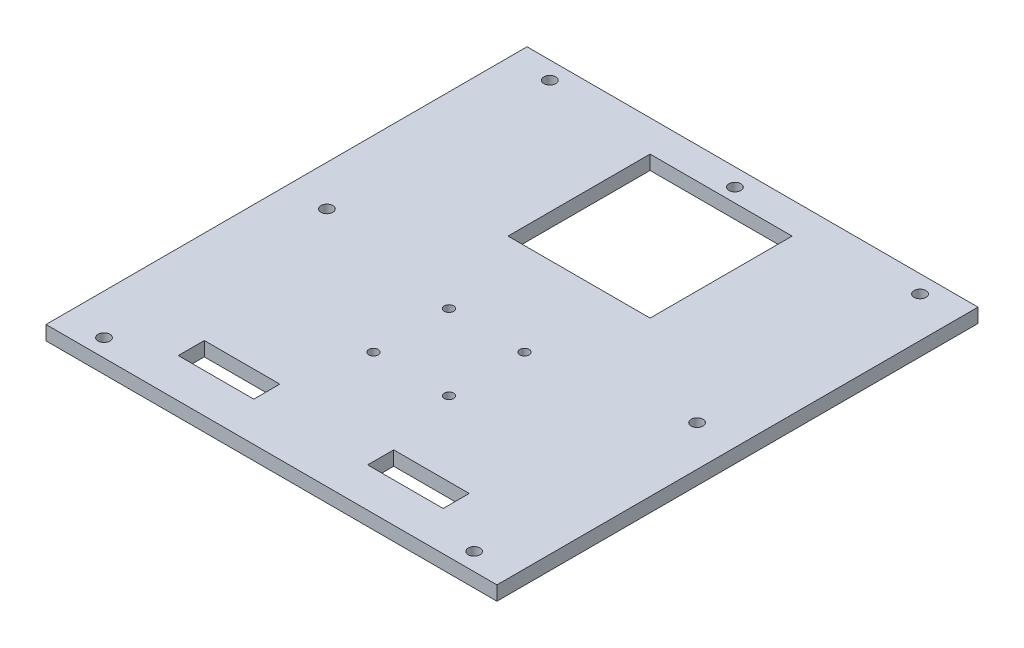
ISO-10303-21;
HEADER;
FILE_DESCRIPTION(('STEP AP214'),'2;1');
FILE_NAME('part.step','',(''),(''),'','','');
FILE_SCHEMA(('AUTOMOTIVE_DESIGN { 1 0 10303 214 1 1 1 1 }'));
ENDSEC;
DATA;
#1=APPLICATION_CONTEXT('core data for automotive mechanical design processes');
#2=APPLICATION_PROTOCOL_DEFINITION('international standard','automotive_design',2000,#1);
#3=PRODUCT_CONTEXT('',#1,'mechanical');
#4=PRODUCT('Part','Part','',(#3));
#5=PRODUCT_RELATED_PRODUCT_CATEGORY('part','',(#4));
#6=PRODUCT_DEFINITION_FORMATION('','',#4);
#7=PRODUCT_DEFINITION_CONTEXT('part definition',#1,'design');
#8=PRODUCT_DEFINITION('design','',#6,#7);
#9=PRODUCT_DEFINITION_SHAPE('','',#8);
#10=(LENGTH_UNIT() NAMED_UNIT(*) SI_UNIT(.MILLI.,.METRE.));
#11=(NAMED_UNIT(*) PLANE_ANGLE_UNIT() SI_UNIT($,.RADIAN.));
#12=(NAMED_UNIT(*) SI_UNIT($,.STERADIAN.) SOLID_ANGLE_UNIT());
#13=UNCERTAINTY_MEASURE_WITH_UNIT(LENGTH_MEASURE(1.E-05),#10,'distance_accuracy_value','');
#14=(GEOMETRIC_REPRESENTATION_CONTEXT(3) GLOBAL_UNCERTAINTY_ASSIGNED_CONTEXT((#13)) GLOBAL_UNIT_ASSIGNED_CONTEXT((#10,
#11,#12)) REPRESENTATION_CONTEXT('',''));
#15=CARTESIAN_POINT('',(0.,0.,0.));
#16=DIRECTION('',(0.,0.,1.));
#17=DIRECTION('',(1.,0.,0.));
#18=AXIS2_PLACEMENT_3D('',#15,#16,#17);
#19=CARTESIAN_POINT('',(0.,6.,0.));
#20=DIRECTION('',(0.,1.,0.));
#21=DIRECTION('',(0.,0.,1.));
#22=AXIS2_PLACEMENT_3D('',#19,#20,#21);
#23=PLANE('',#22);
#24=DIRECTION('',(0.,0.,1.));
#25=VECTOR('',#24,1.);
#26=CARTESIAN_POINT('',(-30.,6.,0.));
#27=LINE('',#26,#25);
#28=CARTESIAN_POINT('',(-30.,6.,-88.3260344038099));
#29=VERTEX_POINT('',#28);
#30=CARTESIAN_POINT('',(-30.,6.,-28.3260344038099));
#31=VERTEX_POINT('',#30);
#32=EDGE_CURVE('E50',#29,#31,#27,.T.);
#33=ORIENTED_EDGE('',*,*,#32,.F.);
#34=DIRECTION('',(1.,0.,0.));
#35=VECTOR('',#34,1.);
#36=CARTESIAN_POINT('',(0.,6.,-88.3260344038099));
#37=LINE('',#36,#35);
#38=CARTESIAN_POINT('',(30.,6.,-88.3260344038099));
#39=VERTEX_POINT('',#38);
#40=EDGE_CURVE('E171',#29,#39,#37,.T.);
#41=ORIENTED_EDGE('',*,*,#40,.T.);
#42=DIRECTION('',(0.,0.,1.));
#43=VECTOR('',#42,1.);
#44=CARTESIAN_POINT('',(30.,6.,0.));
#45=LINE('',#44,#43);
#46=CARTESIAN_POINT('',(30.,6.,-28.3260344038099));
#47=VERTEX_POINT('',#46);
#48=EDGE_CURVE('E155',#39,#47,#45,.T.);
#49=ORIENTED_EDGE('',*,*,#48,.T.);
#50=DIRECTION('',(1.,0.,0.));
#51=VECTOR('',#50,1.);
#52=CARTESIAN_POINT('',(0.,6.,-28.3260344038099));
#53=LINE('',#52,#51);
#54=EDGE_CURVE('E165',#31,#47,#53,.T.);
#55=ORIENTED_EDGE('',*,*,#54,.F.);
#56=EDGE_LOOP('',(#33,#41,#49,#55));
#57=FACE_BOUND('',#56,.T.);
#58=CARTESIAN_POINT('',(15.95,6.,42.5760390110605));
#59=DIRECTION('',(0.,1.,0.));
#60=DIRECTION('',(0.,0.,1.));
#61=AXIS2_PLACEMENT_3D('',#58,#59,#60);
#62=CIRCLE('',#61,2.);
#63=CARTESIAN_POINT('',(15.95,6.,44.5760390110605));
#64=VERTEX_POINT('',#63);
#65=EDGE_CURVE('E185',#64,#64,#62,.T.);
#66=ORIENTED_EDGE('',*,*,#65,.F.);
#67=EDGE_LOOP('',(#66));
#68=FACE_BOUND('',#67,.T.);
#69=CARTESIAN_POINT('',(-15.95,6.,42.5760390110605));
#70=DIRECTION('',(0.,1.,0.));
#71=DIRECTION('',(0.,0.,1.));
#72=AXIS2_PLACEMENT_3D('',#69,#70,#71);
#73=CIRCLE('',#72,2.);
#74=CARTESIAN_POINT('',(-15.95,6.,44.5760390110605));
#75=VERTEX_POINT('',#74);
#76=EDGE_CURVE('E181',#75,#75,#73,.T.);
#77=ORIENTED_EDGE('',*,*,#76,.F.);
#78=EDGE_LOOP('',(#77));
#79=FACE_BOUND('',#78,.T.);
#80=CARTESIAN_POINT('',(-15.95,6.,10.6760390110605));
#81=DIRECTION('',(0.,1.,0.));
#82=DIRECTION('',(0.,0.,1.));
#83=AXIS2_PLACEMENT_3D('',#80,#81,#82);
#84=CIRCLE('',#83,2.);
#85=CARTESIAN_POINT('',(-15.95,6.,12.6760390110605));
#86=VERTEX_POINT('',#85);
#87=EDGE_CURVE('E184',#86,#86,#84,.T.);
#88=ORIENTED_EDGE('',*,*,#87,.F.);
#89=EDGE_LOOP('',(#88));
#90=FACE_BOUND('',#89,.T.);
#91=CARTESIAN_POINT('',(15.95,6.,10.6760390110605));
#92=DIRECTION('',(0.,1.,0.));
#93=DIRECTION('',(0.,0.,1.));
#94=AXIS2_PLACEMENT_3D('',#91,#92,#93);
#95=CIRCLE('',#94,2.);
#96=CARTESIAN_POINT('',(15.95,6.,12.6760390110605));
#97=VERTEX_POINT('',#96);
#98=EDGE_CURVE('E218',#97,#97,#95,.T.);
#99=ORIENTED_EDGE('',*,*,#98,.F.);
#100=EDGE_LOOP('',(#99));
#101=FACE_BOUND('',#100,.T.);
#102=DIRECTION('',(0.,0.,1.));
#103=VECTOR('',#102,1.);
#104=CARTESIAN_POINT('',(-55.95,6.,0.));
#105=LINE('',#104,#103);
#106=CARTESIAN_POINT('',(-55.95,6.,74.0260390110605));
#107=VERTEX_POINT('',#106);
#108=CARTESIAN_POINT('',(-55.95,6.,85.0260390110605));
#109=VERTEX_POINT('',#108);
#110=EDGE_CURVE('E58',#107,#109,#105,.T.);
#111=ORIENTED_EDGE('',*,*,#110,.F.);
#112=DIRECTION('',(-1.,0.,0.));
#113=VECTOR('',#112,1.);
#114=CARTESIAN_POINT('',(0.,6.,74.0260390110605));
#115=LINE('',#114,#113);
#116=CARTESIAN_POINT('',(-24.05,6.,74.0260390110605));
#117=VERTEX_POINT('',#116);
#118=EDGE_CURVE('E211',#117,#107,#115,.T.);
#119=ORIENTED_EDGE('',*,*,#118,.F.);
#120=DIRECTION('',(0.,0.,1.));
#121=VECTOR('',#120,1.);
#122=CARTESIAN_POINT('',(-24.05,6.,0.));
#123=LINE('',#122,#121);
#124=CARTESIAN_POINT('',(-24.05,6.,85.0260390110605));
#125=VERTEX_POINT('',#124);
#126=EDGE_CURVE('E221',#117,#125,#123,.T.);
#127=ORIENTED_EDGE('',*,*,#126,.T.);
#128=DIRECTION('',(1.,0.,0.));
#129=VECTOR('',#128,1.);
#130=CARTESIAN_POINT('',(0.,6.,85.0260390110605));
#131=LINE('',#130,#129);
#132=EDGE_CURVE('E224',#109,#125,#131,.T.);
#133=ORIENTED_EDGE('',*,*,#132,.F.);
#134=EDGE_LOOP('',(#111,#119,#127,#133));
#135=FACE_BOUND('',#134,.T.);
#136=CARTESIAN_POINT('',(78.1870361579999,6.,94.1650737980001));
#137=DIRECTION('',(0.,1.,0.));
#138=DIRECTION('',(0.,0.,1.));
#139=AXIS2_PLACEMENT_3D('',#136,#137,#138);
#140=CIRCLE('',#139,2.5);
#141=CARTESIAN_POINT('',(78.1870361579999,6.,96.6650737980001));
#142=VERTEX_POINT('',#141);
#143=EDGE_CURVE('E263',#142,#142,#140,.T.);
#144=ORIENTED_EDGE('',*,*,#143,.F.);
#145=EDGE_LOOP('',(#144));
#146=FACE_BOUND('',#145,.T.);
#147=CARTESIAN_POINT('',(78.187036158,6.,-94.165073798));
#148=DIRECTION('',(0.,-1.,0.));
#149=DIRECTION('',(0.,0.,-1.));
#150=AXIS2_PLACEMENT_3D('',#147,#148,#149);
#151=CIRCLE('',#150,2.5);
#152=CARTESIAN_POINT('',(78.187036158,6.,-96.6650737980001));
#153=VERTEX_POINT('',#152);
#154=EDGE_CURVE('E239',#153,#153,#151,.T.);
#155=ORIENTED_EDGE('',*,*,#154,.T.);
#156=EDGE_LOOP('',(#155));
#157=FACE_BOUND('',#156,.T.);
#158=CARTESIAN_POINT('',(0.,6.,-94.165073798));
#159=DIRECTION('',(0.,1.,0.));
#160=DIRECTION('',(0.,0.,1.));
#161=AXIS2_PLACEMENT_3D('',#158,#159,#160);
#162=CIRCLE('',#161,2.5);
#163=CARTESIAN_POINT('',(0.,6.,-91.665073798));
#164=VERTEX_POINT('',#163);
#165=EDGE_CURVE('E232',#164,#164,#162,.T.);
#166=ORIENTED_EDGE('',*,*,#165,.F.);
#167=EDGE_LOOP('',(#166));
#168=FACE_BOUND('',#167,.T.);
#169=CARTESIAN_POINT('',(-78.187036158,6.,-94.165073798));
#170=DIRECTION('',(0.,1.,0.));
#171=DIRECTION('',(0.,0.,1.));
#172=AXIS2_PLACEMENT_3D('',#169,#170,#171);
#173=CIRCLE('',#172,2.5);
#174=CARTESIAN_POINT('',(-78.187036158,6.,-91.665073798));
#175=VERTEX_POINT('',#174);
#176=EDGE_CURVE('E235',#175,#175,#173,.T.);
#177=ORIENTED_EDGE('',*,*,#176,.F.);
#178=EDGE_LOOP('',(#177));
#179=FACE_BOUND('',#178,.T.);
#180=DIRECTION('',(0.,0.,-1.));
#181=VECTOR('',#180,1.);
#182=CARTESIAN_POINT('',(95.25,6.,-101.6));
#183=LINE('',#182,#181);
#184=CARTESIAN_POINT('',(95.25,6.,101.6));
#185=VERTEX_POINT('',#184);
#186=CARTESIAN_POINT('',(95.25,6.,-101.6));
#187=VERTEX_POINT('',#186);
#188=EDGE_CURVE('E276',#185,#187,#183,.T.);
#189=ORIENTED_EDGE('',*,*,#188,.T.);
#190=DIRECTION('',(-1.,0.,0.));
#191=VECTOR('',#190,1.);
#192=CARTESIAN_POINT('',(-95.25,6.,-101.6));
#193=LINE('',#192,#191);
#194=CARTESIAN_POINT('',(-95.25,6.,-101.6));
#195=VERTEX_POINT('',#194);
#196=EDGE_CURVE('E279',#187,#195,#193,.T.);
#197=ORIENTED_EDGE('',*,*,#196,.T.);
#198=DIRECTION('',(0.,0.,1.));
#199=VECTOR('',#198,1.);
#200=CARTESIAN_POINT('',(-95.25,6.,-101.6));
#201=LINE('',#200,#199);
#202=CARTESIAN_POINT('',(-95.25,6.,101.6));
#203=VERTEX_POINT('',#202);
#204=EDGE_CURVE('E282',#195,#203,#201,.T.);
#205=ORIENTED_EDGE('',*,*,#204,.T.);
#206=DIRECTION('',(1.,0.,0.));
#207=VECTOR('',#206,1.);
#208=CARTESIAN_POINT('',(-95.25,6.,101.6));
#209=LINE('',#208,#207);
#210=EDGE_CURVE('E284',#203,#185,#209,.T.);
#211=ORIENTED_EDGE('',*,*,#210,.T.);
#212=EDGE_LOOP('',(#189,#197,#205,#211));
#213=FACE_BOUND('',#212,.T.);
#214=CARTESIAN_POINT('',(-78.187036158,6.,0.));
#215=DIRECTION('',(0.,1.,0.));
#216=DIRECTION('',(0.,0.,1.));
#217=AXIS2_PLACEMENT_3D('',#214,#215,#216);
#218=CIRCLE('',#217,2.50000000000001);
#219=CARTESIAN_POINT('',(-78.187036158,6.,2.5));
#220=VERTEX_POINT('',#219);
#221=EDGE_CURVE('E245',#220,#220,#218,.T.);
#222=ORIENTED_EDGE('',*,*,#221,.F.);
#223=EDGE_LOOP('',(#222));
#224=FACE_BOUND('',#223,.T.);
#225=CARTESIAN_POINT('',(78.1870361579999,6.,0.));
#226=DIRECTION('',(0.,1.,0.));
#227=DIRECTION('',(0.,0.,1.));
#228=AXIS2_PLACEMENT_3D('',#225,#226,#227);
#229=CIRCLE('',#228,2.50000000000001);
#230=CARTESIAN_POINT('',(78.1870361579999,6.,2.5));
#231=VERTEX_POINT('',#230);
#232=EDGE_CURVE('E251',#231,#231,#229,.T.);
#233=ORIENTED_EDGE('',*,*,#232,.F.);
#234=EDGE_LOOP('',(#233));
#235=FACE_BOUND('',#234,.T.);
#236=CARTESIAN_POINT('',(-78.1870361580001,6.,94.165073798));
#237=DIRECTION('',(0.,-1.,0.));
#238=DIRECTION('',(0.,0.,-1.));
#239=AXIS2_PLACEMENT_3D('',#236,#237,#238);
#240=CIRCLE('',#239,2.5);
#241=CARTESIAN_POINT('',(-78.1870361580001,6.,91.665073798));
#242=VERTEX_POINT('',#241);
#243=EDGE_CURVE('E257',#242,#242,#240,.T.);
#244=ORIENTED_EDGE('',*,*,#243,.T.);
#245=EDGE_LOOP('',(#244));
#246=FACE_BOUND('',#245,.T.);
#247=DIRECTION('',(0.,0.,1.));
#248=VECTOR('',#247,1.);
#249=CARTESIAN_POINT('',(55.95,6.,0.));
#250=LINE('',#249,#248);
#251=CARTESIAN_POINT('',(55.95,6.,74.0260390110605));
#252=VERTEX_POINT('',#251);
#253=CARTESIAN_POINT('',(55.95,6.,85.0260390110605));
#254=VERTEX_POINT('',#253);
#255=EDGE_CURVE('E203',#252,#254,#250,.T.);
#256=ORIENTED_EDGE('',*,*,#255,.T.);
#257=DIRECTION('',(-1.,0.,0.));
#258=VECTOR('',#257,1.);
#259=CARTESIAN_POINT('',(0.,6.,85.0260390110605));
#260=LINE('',#259,#258);
#261=CARTESIAN_POINT('',(24.05,6.,85.0260390110605));
#262=VERTEX_POINT('',#261);
#263=EDGE_CURVE('E206',#254,#262,#260,.T.);
#264=ORIENTED_EDGE('',*,*,#263,.T.);
#265=DIRECTION('',(0.,0.,-1.));
#266=VECTOR('',#265,1.);
#267=CARTESIAN_POINT('',(24.05,6.,0.));
#268=LINE('',#267,#266);
#269=CARTESIAN_POINT('',(24.05,6.,74.0260390110605));
#270=VERTEX_POINT('',#269);
#271=EDGE_CURVE('E191',#262,#270,#268,.T.);
#272=ORIENTED_EDGE('',*,*,#271,.T.);
#273=DIRECTION('',(1.,0.,0.));
#274=VECTOR('',#273,1.);
#275=CARTESIAN_POINT('',(0.,6.,74.0260390110605));
#276=LINE('',#275,#274);
#277=EDGE_CURVE('E200',#270,#252,#276,.T.);
#278=ORIENTED_EDGE('',*,*,#277,.T.);
#279=EDGE_LOOP('',(#256,#264,#272,#278));
#280=FACE_BOUND('',#279,.T.);
#281=ADVANCED_FACE('F35',(#57,#68,#79,#90,#101,#135,#146,#157,#168,#179,#213,#224,#235,#246,
#280),#23,.T.);
#282=CARTESIAN_POINT('',(0.,0.,0.));
#283=DIRECTION('',(0.,1.,0.));
#284=DIRECTION('',(0.,0.,1.));
#285=AXIS2_PLACEMENT_3D('',#282,#283,#284);
#286=PLANE('',#285);
#287=DIRECTION('',(1.,0.,0.));
#288=VECTOR('',#287,1.);
#289=CARTESIAN_POINT('',(0.,0.,-88.3260344038099));
#290=LINE('',#289,#288);
#291=CARTESIAN_POINT('',(-30.,0.,-88.3260344038099));
#292=VERTEX_POINT('',#291);
#293=CARTESIAN_POINT('',(30.,0.,-88.3260344038099));
#294=VERTEX_POINT('',#293);
#295=EDGE_CURVE('E43',#292,#294,#290,.T.);
#296=ORIENTED_EDGE('',*,*,#295,.F.);
#297=DIRECTION('',(0.,0.,1.));
#298=VECTOR('',#297,1.);
#299=CARTESIAN_POINT('',(-30.,0.,0.));
#300=LINE('',#299,#298);
#301=CARTESIAN_POINT('',(-30.,0.,-28.3260344038099));
#302=VERTEX_POINT('',#301);
#303=EDGE_CURVE('E11',#292,#302,#300,.T.);
#304=ORIENTED_EDGE('',*,*,#303,.T.);
#305=DIRECTION('',(1.,0.,0.));
#306=VECTOR('',#305,1.);
#307=CARTESIAN_POINT('',(0.,0.,-28.3260344038099));
#308=LINE('',#307,#306);
#309=CARTESIAN_POINT('',(30.,0.,-28.3260344038099));
#310=VERTEX_POINT('',#309);
#311=EDGE_CURVE('E326',#302,#310,#308,.T.);
#312=ORIENTED_EDGE('',*,*,#311,.T.);
#313=DIRECTION('',(0.,0.,1.));
#314=VECTOR('',#313,1.);
#315=CARTESIAN_POINT('',(30.,0.,0.));
#316=LINE('',#315,#314);
#317=EDGE_CURVE('E158',#294,#310,#316,.T.);
#318=ORIENTED_EDGE('',*,*,#317,.F.);
#319=EDGE_LOOP('',(#296,#304,#312,#318));
#320=FACE_BOUND('',#319,.T.);
#321=CARTESIAN_POINT('',(15.95,0.,42.5760390110605));
#322=DIRECTION('',(0.,1.,0.));
#323=DIRECTION('',(0.,0.,1.));
#324=AXIS2_PLACEMENT_3D('',#321,#322,#323);
#325=CIRCLE('',#324,2.);
#326=CARTESIAN_POINT('',(15.95,0.,44.5760390110605));
#327=VERTEX_POINT('',#326);
#328=EDGE_CURVE('E269',#327,#327,#325,.T.);
#329=ORIENTED_EDGE('',*,*,#328,.T.);
#330=EDGE_LOOP('',(#329));
#331=FACE_BOUND('',#330,.T.);
#332=CARTESIAN_POINT('',(-15.95,0.,42.5760390110605));
#333=DIRECTION('',(0.,1.,0.));
#334=DIRECTION('',(0.,0.,1.));
#335=AXIS2_PLACEMENT_3D('',#332,#333,#334);
#336=CIRCLE('',#335,2.);
#337=CARTESIAN_POINT('',(-15.95,0.,44.5760390110605));
#338=VERTEX_POINT('',#337);
#339=EDGE_CURVE('E332',#338,#338,#336,.T.);
#340=ORIENTED_EDGE('',*,*,#339,.T.);
#341=EDGE_LOOP('',(#340));
#342=FACE_BOUND('',#341,.T.);
#343=CARTESIAN_POINT('',(-15.95,0.,10.6760390110605));
#344=DIRECTION('',(0.,1.,0.));
#345=DIRECTION('',(0.,0.,1.));
#346=AXIS2_PLACEMENT_3D('',#343,#344,#345);
#347=CIRCLE('',#346,2.);
#348=CARTESIAN_POINT('',(-15.95,0.,12.6760390110605));
#349=VERTEX_POINT('',#348);
#350=EDGE_CURVE('E329',#349,#349,#347,.T.);
#351=ORIENTED_EDGE('',*,*,#350,.T.);
#352=EDGE_LOOP('',(#351));
#353=FACE_BOUND('',#352,.T.);
#354=CARTESIAN_POINT('',(15.95,0.,10.6760390110605));
#355=DIRECTION('',(0.,1.,0.));
#356=DIRECTION('',(0.,0.,1.));
#357=AXIS2_PLACEMENT_3D('',#354,#355,#356);
#358=CIRCLE('',#357,2.);
#359=CARTESIAN_POINT('',(15.95,0.,12.6760390110605));
#360=VERTEX_POINT('',#359);
#361=EDGE_CURVE('E178',#360,#360,#358,.T.);
#362=ORIENTED_EDGE('',*,*,#361,.T.);
#363=EDGE_LOOP('',(#362));
#364=FACE_BOUND('',#363,.T.);
#365=DIRECTION('',(-1.,0.,0.));
#366=VECTOR('',#365,1.);
#367=CARTESIAN_POINT('',(0.,0.,74.0260390110605));
#368=LINE('',#367,#366);
#369=CARTESIAN_POINT('',(-24.05,0.,74.0260390110605));
#370=VERTEX_POINT('',#369);
#371=CARTESIAN_POINT('',(-55.95,0.,74.0260390110605));
#372=VERTEX_POINT('',#371);
#373=EDGE_CURVE('E320',#370,#372,#368,.T.);
#374=ORIENTED_EDGE('',*,*,#373,.T.);
#375=DIRECTION('',(0.,0.,1.));
#376=VECTOR('',#375,1.);
#377=CARTESIAN_POINT('',(-55.95,0.,0.));
#378=LINE('',#377,#376);
#379=CARTESIAN_POINT('',(-55.95,0.,85.0260390110605));
#380=VERTEX_POINT('',#379);
#381=EDGE_CURVE('E323',#372,#380,#378,.T.);
#382=ORIENTED_EDGE('',*,*,#381,.T.);
#383=DIRECTION('',(1.,0.,0.));
#384=VECTOR('',#383,1.);
#385=CARTESIAN_POINT('',(0.,0.,85.0260390110605));
#386=LINE('',#385,#384);
#387=CARTESIAN_POINT('',(-24.05,0.,85.0260390110605));
#388=VERTEX_POINT('',#387);
#389=EDGE_CURVE('E314',#380,#388,#386,.T.);
#390=ORIENTED_EDGE('',*,*,#389,.T.);
#391=DIRECTION('',(0.,0.,1.));
#392=VECTOR('',#391,1.);
#393=CARTESIAN_POINT('',(-24.05,0.,0.));
#394=LINE('',#393,#392);
#395=EDGE_CURVE('E317',#370,#388,#394,.T.);
#396=ORIENTED_EDGE('',*,*,#395,.F.);
#397=EDGE_LOOP('',(#374,#382,#390,#396));
#398=FACE_BOUND('',#397,.T.);
#399=CARTESIAN_POINT('',(-78.1870361580001,0.,94.165073798));
#400=DIRECTION('',(0.,-1.,0.));
#401=DIRECTION('',(0.,0.,-1.));
#402=AXIS2_PLACEMENT_3D('',#399,#400,#401);
#403=CIRCLE('',#402,2.5);
#404=CARTESIAN_POINT('',(-78.1870361580001,0.,91.665073798));
#405=VERTEX_POINT('',#404);
#406=EDGE_CURVE('E260',#405,#405,#403,.T.);
#407=ORIENTED_EDGE('',*,*,#406,.F.);
#408=EDGE_LOOP('',(#407));
#409=FACE_BOUND('',#408,.T.);
#410=CARTESIAN_POINT('',(78.187036158,0.,-94.165073798));
#411=DIRECTION('',(0.,-1.,0.));
#412=DIRECTION('',(0.,0.,-1.));
#413=AXIS2_PLACEMENT_3D('',#410,#411,#412);
#414=CIRCLE('',#413,2.5);
#415=CARTESIAN_POINT('',(78.187036158,0.,-96.6650737980001));
#416=VERTEX_POINT('',#415);
#417=EDGE_CURVE('E242',#416,#416,#414,.T.);
#418=ORIENTED_EDGE('',*,*,#417,.F.);
#419=EDGE_LOOP('',(#418));
#420=FACE_BOUND('',#419,.T.);
#421=DIRECTION('',(0.,0.,-1.));
#422=VECTOR('',#421,1.);
#423=CARTESIAN_POINT('',(95.25,0.,-101.6));
#424=LINE('',#423,#422);
#425=CARTESIAN_POINT('',(95.25,0.,101.6));
#426=VERTEX_POINT('',#425);
#427=CARTESIAN_POINT('',(95.25,0.,-101.6));
#428=VERTEX_POINT('',#427);
#429=EDGE_CURVE('E273',#426,#428,#424,.T.);
#430=ORIENTED_EDGE('',*,*,#429,.F.);
#431=DIRECTION('',(1.,0.,0.));
#432=VECTOR('',#431,1.);
#433=CARTESIAN_POINT('',(-95.25,0.,101.6));
#434=LINE('',#433,#432);
#435=CARTESIAN_POINT('',(-95.25,0.,101.6));
#436=VERTEX_POINT('',#435);
#437=EDGE_CURVE('E280',#436,#426,#434,.T.);
#438=ORIENTED_EDGE('',*,*,#437,.F.);
#439=DIRECTION('',(0.,0.,1.));
#440=VECTOR('',#439,1.);
#441=CARTESIAN_POINT('',(-95.25,0.,-101.6));
#442=LINE('',#441,#440);
#443=CARTESIAN_POINT('',(-95.25,0.,-101.6));
#444=VERTEX_POINT('',#443);
#445=EDGE_CURVE('E291',#444,#436,#442,.T.);
#446=ORIENTED_EDGE('',*,*,#445,.F.);
#447=DIRECTION('',(-1.,0.,0.));
#448=VECTOR('',#447,1.);
#449=CARTESIAN_POINT('',(-95.25,0.,-101.6));
#450=LINE('',#449,#448);
#451=EDGE_CURVE('E289',#428,#444,#450,.T.);
#452=ORIENTED_EDGE('',*,*,#451,.F.);
#453=EDGE_LOOP('',(#430,#438,#446,#452));
#454=FACE_BOUND('',#453,.T.);
#455=CARTESIAN_POINT('',(-78.187036158,0.,-94.165073798));
#456=DIRECTION('',(0.,1.,0.));
#457=DIRECTION('',(0.,0.,1.));
#458=AXIS2_PLACEMENT_3D('',#455,#456,#457);
#459=CIRCLE('',#458,2.5);
#460=CARTESIAN_POINT('',(-78.187036158,0.,-91.665073798));
#461=VERTEX_POINT('',#460);
#462=EDGE_CURVE('E270',#461,#461,#459,.T.);
#463=ORIENTED_EDGE('',*,*,#462,.T.);
#464=EDGE_LOOP('',(#463));
#465=FACE_BOUND('',#464,.T.);
#466=CARTESIAN_POINT('',(0.,0.,-94.165073798));
#467=DIRECTION('',(0.,1.,0.));
#468=DIRECTION('',(0.,0.,1.));
#469=AXIS2_PLACEMENT_3D('',#466,#467,#468);
#470=CIRCLE('',#469,2.5);
#471=CARTESIAN_POINT('',(0.,0.,-91.665073798));
#472=VERTEX_POINT('',#471);
#473=EDGE_CURVE('E236',#472,#472,#470,.T.);
#474=ORIENTED_EDGE('',*,*,#473,.T.);
#475=EDGE_LOOP('',(#474));
#476=FACE_BOUND('',#475,.T.);
#477=CARTESIAN_POINT('',(-78.187036158,0.,0.));
#478=DIRECTION('',(0.,1.,0.));
#479=DIRECTION('',(0.,0.,1.));
#480=AXIS2_PLACEMENT_3D('',#477,#478,#479);
#481=CIRCLE('',#480,2.50000000000001);
#482=CARTESIAN_POINT('',(-78.187036158,0.,2.5));
#483=VERTEX_POINT('',#482);
#484=EDGE_CURVE('E248',#483,#483,#481,.T.);
#485=ORIENTED_EDGE('',*,*,#484,.T.);
#486=EDGE_LOOP('',(#485));
#487=FACE_BOUND('',#486,.T.);
#488=CARTESIAN_POINT('',(78.1870361579999,0.,0.));
#489=DIRECTION('',(0.,1.,0.));
#490=DIRECTION('',(0.,0.,1.));
#491=AXIS2_PLACEMENT_3D('',#488,#489,#490);
#492=CIRCLE('',#491,2.50000000000001);
#493=CARTESIAN_POINT('',(78.1870361579999,0.,2.5));
#494=VERTEX_POINT('',#493);
#495=EDGE_CURVE('E254',#494,#494,#492,.T.);
#496=ORIENTED_EDGE('',*,*,#495,.T.);
#497=EDGE_LOOP('',(#496));
#498=FACE_BOUND('',#497,.T.);
#499=CARTESIAN_POINT('',(78.1870361579999,0.,94.1650737980001));
#500=DIRECTION('',(0.,1.,0.));
#501=DIRECTION('',(0.,0.,1.));
#502=AXIS2_PLACEMENT_3D('',#499,#500,#501);
#503=CIRCLE('',#502,2.5);
#504=CARTESIAN_POINT('',(78.1870361579999,0.,96.6650737980001));
#505=VERTEX_POINT('',#504);
#506=EDGE_CURVE('E266',#505,#505,#503,.T.);
#507=ORIENTED_EDGE('',*,*,#506,.T.);
#508=EDGE_LOOP('',(#507));
#509=FACE_BOUND('',#508,.T.);
#510=DIRECTION('',(-1.,0.,0.));
#511=VECTOR('',#510,1.);
#512=CARTESIAN_POINT('',(0.,0.,85.0260390110605));
#513=LINE('',#512,#511);
#514=CARTESIAN_POINT('',(55.95,0.,85.0260390110605));
#515=VERTEX_POINT('',#514);
#516=CARTESIAN_POINT('',(24.05,0.,85.0260390110605));
#517=VERTEX_POINT('',#516);
#518=EDGE_CURVE('E312',#515,#517,#513,.T.);
#519=ORIENTED_EDGE('',*,*,#518,.F.);
#520=DIRECTION('',(0.,0.,1.));
#521=VECTOR('',#520,1.);
#522=CARTESIAN_POINT('',(55.95,0.,0.));
#523=LINE('',#522,#521);
#524=CARTESIAN_POINT('',(55.95,0.,74.0260390110605));
#525=VERTEX_POINT('',#524);
#526=EDGE_CURVE('E305',#525,#515,#523,.T.);
#527=ORIENTED_EDGE('',*,*,#526,.F.);
#528=DIRECTION('',(1.,0.,0.));
#529=VECTOR('',#528,1.);
#530=CARTESIAN_POINT('',(0.,0.,74.0260390110605));
#531=LINE('',#530,#529);
#532=CARTESIAN_POINT('',(24.05,0.,74.0260390110605));
#533=VERTEX_POINT('',#532);
#534=EDGE_CURVE('E307',#533,#525,#531,.T.);
#535=ORIENTED_EDGE('',*,*,#534,.F.);
#536=DIRECTION('',(0.,0.,-1.));
#537=VECTOR('',#536,1.);
#538=CARTESIAN_POINT('',(24.05,0.,0.));
#539=LINE('',#538,#537);
#540=EDGE_CURVE('E310',#517,#533,#539,.T.);
#541=ORIENTED_EDGE('',*,*,#540,.F.);
#542=EDGE_LOOP('',(#519,#527,#535,#541));
#543=FACE_BOUND('',#542,.T.);
#544=ADVANCED_FACE('F343',(#320,#331,#342,#353,#364,#398,#409,#420,#454,#465,#476,#487,#498,
#509,#543),#286,.F.);
#545=CARTESIAN_POINT('',(95.25,6.,-101.6));
#546=DIRECTION('',(-1.,0.,0.));
#547=DIRECTION('',(0.,0.,1.));
#548=AXIS2_PLACEMENT_3D('',#545,#546,#547);
#549=PLANE('',#548);
#550=ORIENTED_EDGE('',*,*,#429,.T.);
#551=DIRECTION('',(0.,-1.,0.));
#552=VECTOR('',#551,1.);
#553=CARTESIAN_POINT('',(95.25,6.,-101.6));
#554=LINE('',#553,#552);
#555=EDGE_CURVE('E302',#187,#428,#554,.T.);
#556=ORIENTED_EDGE('',*,*,#555,.F.);
#557=ORIENTED_EDGE('',*,*,#188,.F.);
#558=DIRECTION('',(0.,-1.,0.));
#559=VECTOR('',#558,1.);
#560=CARTESIAN_POINT('',(95.25,6.,101.6));
#561=LINE('',#560,#559);
#562=EDGE_CURVE('E286',#185,#426,#561,.T.);
#563=ORIENTED_EDGE('',*,*,#562,.T.);
#564=EDGE_LOOP('',(#550,#556,#557,#563));
#565=FACE_BOUND('',#564,.T.);
#566=ADVANCED_FACE('F37',(#565),#549,.F.);
#567=CARTESIAN_POINT('',(-95.25,6.,-101.6));
#568=DIRECTION('',(0.,0.,1.));
#569=DIRECTION('',(1.,0.,0.));
#570=AXIS2_PLACEMENT_3D('',#567,#568,#569);
#571=PLANE('',#570);
#572=ORIENTED_EDGE('',*,*,#451,.T.);
#573=DIRECTION('',(0.,-1.,0.));
#574=VECTOR('',#573,1.);
#575=CARTESIAN_POINT('',(-95.25,6.,-101.6));
#576=LINE('',#575,#574);
#577=EDGE_CURVE('E299',#195,#444,#576,.T.);
#578=ORIENTED_EDGE('',*,*,#577,.F.);
#579=ORIENTED_EDGE('',*,*,#196,.F.);
#580=ORIENTED_EDGE('',*,*,#555,.T.);
#581=EDGE_LOOP('',(#572,#578,#579,#580));
#582=FACE_BOUND('',#581,.T.);
#583=ADVANCED_FACE('F375',(#582),#571,.F.);
#584=CARTESIAN_POINT('',(-95.25,6.,-101.6));
#585=DIRECTION('',(1.,0.,0.));
#586=DIRECTION('',(0.,0.,-1.));
#587=AXIS2_PLACEMENT_3D('',#584,#585,#586);
#588=PLANE('',#587);
#589=ORIENTED_EDGE('',*,*,#445,.T.);
#590=DIRECTION('',(0.,-1.,0.));
#591=VECTOR('',#590,1.);
#592=CARTESIAN_POINT('',(-95.25,6.,101.6));
#593=LINE('',#592,#591);
#594=EDGE_CURVE('E296',#203,#436,#593,.T.);
#595=ORIENTED_EDGE('',*,*,#594,.F.);
#596=ORIENTED_EDGE('',*,*,#204,.F.);
#597=ORIENTED_EDGE('',*,*,#577,.T.);
#598=EDGE_LOOP('',(#589,#595,#596,#597));
#599=FACE_BOUND('',#598,.T.);
#600=ADVANCED_FACE('F372',(#599),#588,.F.);
#601=CARTESIAN_POINT('',(-95.25,6.,101.6));
#602=DIRECTION('',(0.,0.,-1.));
#603=DIRECTION('',(-1.,0.,0.));
#604=AXIS2_PLACEMENT_3D('',#601,#602,#603);
#605=PLANE('',#604);
#606=ORIENTED_EDGE('',*,*,#437,.T.);
#607=ORIENTED_EDGE('',*,*,#562,.F.);
#608=ORIENTED_EDGE('',*,*,#210,.F.);
#609=ORIENTED_EDGE('',*,*,#594,.T.);
#610=EDGE_LOOP('',(#606,#607,#608,#609));
#611=FACE_BOUND('',#610,.T.);
#612=ADVANCED_FACE('F369',(#611),#605,.F.);
#613=CARTESIAN_POINT('',(-78.187036158,0.,-94.165073798));
#614=DIRECTION('',(0.,1.,0.));
#615=DIRECTION('',(0.,0.,1.));
#616=AXIS2_PLACEMENT_3D('',#613,#614,#615);
#617=CYLINDRICAL_SURFACE('',#616,2.5);
#618=ORIENTED_EDGE('',*,*,#462,.F.);
#619=EDGE_LOOP('',(#618));
#620=FACE_BOUND('',#619,.T.);
#621=ORIENTED_EDGE('',*,*,#176,.T.);
#622=EDGE_LOOP('',(#621));
#623=FACE_BOUND('',#622,.T.);
#624=ADVANCED_FACE('F366',(#620,#623),#617,.F.);
#625=CARTESIAN_POINT('',(0.,0.,-94.165073798));
#626=DIRECTION('',(0.,1.,0.));
#627=DIRECTION('',(0.,0.,1.));
#628=AXIS2_PLACEMENT_3D('',#625,#626,#627);
#629=CYLINDRICAL_SURFACE('',#628,2.5);
#630=ORIENTED_EDGE('',*,*,#473,.F.);
#631=EDGE_LOOP('',(#630));
#632=FACE_BOUND('',#631,.T.);
#633=ORIENTED_EDGE('',*,*,#165,.T.);
#634=EDGE_LOOP('',(#633));
#635=FACE_BOUND('',#634,.T.);
#636=ADVANCED_FACE('F455',(#632,#635),#629,.F.);
#637=CARTESIAN_POINT('',(78.187036158,0.,-94.165073798));
#638=DIRECTION('',(0.,1.,0.));
#639=DIRECTION('',(0.,0.,1.));
#640=AXIS2_PLACEMENT_3D('',#637,#638,#639);
#641=CYLINDRICAL_SURFACE('',#640,2.5);
#642=ORIENTED_EDGE('',*,*,#417,.T.);
#643=EDGE_LOOP('',(#642));
#644=FACE_BOUND('',#643,.T.);
#645=ORIENTED_EDGE('',*,*,#154,.F.);
#646=EDGE_LOOP('',(#645));
#647=FACE_BOUND('',#646,.T.);
#648=ADVANCED_FACE('F458',(#644,#647),#641,.F.);
#649=CARTESIAN_POINT('',(-78.187036158,0.,0.));
#650=DIRECTION('',(0.,1.,0.));
#651=DIRECTION('',(0.,0.,1.));
#652=AXIS2_PLACEMENT_3D('',#649,#650,#651);
#653=CYLINDRICAL_SURFACE('',#652,2.50000000000001);
#654=ORIENTED_EDGE('',*,*,#484,.F.);
#655=EDGE_LOOP('',(#654));
#656=FACE_BOUND('',#655,.T.);
#657=ORIENTED_EDGE('',*,*,#221,.T.);
#658=EDGE_LOOP('',(#657));
#659=FACE_BOUND('',#658,.T.);
#660=ADVANCED_FACE('F462',(#656,#659),#653,.F.);
#661=CARTESIAN_POINT('',(78.1870361579999,0.,0.));
#662=DIRECTION('',(0.,1.,0.));
#663=DIRECTION('',(0.,0.,1.));
#664=AXIS2_PLACEMENT_3D('',#661,#662,#663);
#665=CYLINDRICAL_SURFACE('',#664,2.50000000000001);
#666=ORIENTED_EDGE('',*,*,#495,.F.);
#667=EDGE_LOOP('',(#666));
#668=FACE_BOUND('',#667,.T.);
#669=ORIENTED_EDGE('',*,*,#232,.T.);
#670=EDGE_LOOP('',(#669));
#671=FACE_BOUND('',#670,.T.);
#672=ADVANCED_FACE('F466',(#668,#671),#665,.F.);
#673=CARTESIAN_POINT('',(-78.1870361580001,0.,94.165073798));
#674=DIRECTION('',(0.,1.,0.));
#675=DIRECTION('',(0.,0.,1.));
#676=AXIS2_PLACEMENT_3D('',#673,#674,#675);
#677=CYLINDRICAL_SURFACE('',#676,2.5);
#678=ORIENTED_EDGE('',*,*,#406,.T.);
#679=EDGE_LOOP('',(#678));
#680=FACE_BOUND('',#679,.T.);
#681=ORIENTED_EDGE('',*,*,#243,.F.);
#682=EDGE_LOOP('',(#681));
#683=FACE_BOUND('',#682,.T.);
#684=ADVANCED_FACE('F470',(#680,#683),#677,.F.);
#685=CARTESIAN_POINT('',(78.1870361579999,0.,94.1650737980001));
#686=DIRECTION('',(0.,1.,0.));
#687=DIRECTION('',(0.,0.,1.));
#688=AXIS2_PLACEMENT_3D('',#685,#686,#687);
#689=CYLINDRICAL_SURFACE('',#688,2.5);
#690=ORIENTED_EDGE('',*,*,#506,.F.);
#691=EDGE_LOOP('',(#690));
#692=FACE_BOUND('',#691,.T.);
#693=ORIENTED_EDGE('',*,*,#143,.T.);
#694=EDGE_LOOP('',(#693));
#695=FACE_BOUND('',#694,.T.);
#696=ADVANCED_FACE('F473',(#692,#695),#689,.F.);
#697=CARTESIAN_POINT('',(0.,-4.,85.0260390110605));
#698=DIRECTION('',(0.,0.,-1.));
#699=DIRECTION('',(-1.,0.,0.));
#700=AXIS2_PLACEMENT_3D('',#697,#698,#699);
#701=PLANE('',#700);
#702=ORIENTED_EDGE('',*,*,#518,.T.);
#703=DIRECTION('',(0.,1.,0.));
#704=VECTOR('',#703,1.);
#705=CARTESIAN_POINT('',(24.05,-4.,85.0260390110605));
#706=LINE('',#705,#704);
#707=EDGE_CURVE('E196',#517,#262,#706,.T.);
#708=ORIENTED_EDGE('',*,*,#707,.T.);
#709=ORIENTED_EDGE('',*,*,#263,.F.);
#710=DIRECTION('',(0.,1.,0.));
#711=VECTOR('',#710,1.);
#712=CARTESIAN_POINT('',(55.95,-4.,85.0260390110605));
#713=LINE('',#712,#711);
#714=EDGE_CURVE('E188',#515,#254,#713,.T.);
#715=ORIENTED_EDGE('',*,*,#714,.F.);
#716=EDGE_LOOP('',(#702,#708,#709,#715));
#717=FACE_BOUND('',#716,.T.);
#718=ADVANCED_FACE('F411',(#717),#701,.T.);
#719=CARTESIAN_POINT('',(24.05,-4.,0.));
#720=DIRECTION('',(1.,0.,0.));
#721=DIRECTION('',(0.,0.,-1.));
#722=AXIS2_PLACEMENT_3D('',#719,#720,#721);
#723=PLANE('',#722);
#724=ORIENTED_EDGE('',*,*,#540,.T.);
#725=DIRECTION('',(0.,1.,0.));
#726=VECTOR('',#725,1.);
#727=CARTESIAN_POINT('',(24.05,-4.,74.0260390110605));
#728=LINE('',#727,#726);
#729=EDGE_CURVE('E194',#533,#270,#728,.T.);
#730=ORIENTED_EDGE('',*,*,#729,.T.);
#731=ORIENTED_EDGE('',*,*,#271,.F.);
#732=ORIENTED_EDGE('',*,*,#707,.F.);
#733=EDGE_LOOP('',(#724,#730,#731,#732));
#734=FACE_BOUND('',#733,.T.);
#735=ADVANCED_FACE('F418',(#734),#723,.T.);
#736=CARTESIAN_POINT('',(0.,-4.,74.0260390110605));
#737=DIRECTION('',(0.,0.,1.));
#738=DIRECTION('',(1.,0.,0.));
#739=AXIS2_PLACEMENT_3D('',#736,#737,#738);
#740=PLANE('',#739);
#741=ORIENTED_EDGE('',*,*,#534,.T.);
#742=DIRECTION('',(0.,1.,0.));
#743=VECTOR('',#742,1.);
#744=CARTESIAN_POINT('',(55.95,-4.,74.0260390110605));
#745=LINE('',#744,#743);
#746=EDGE_CURVE('E192',#525,#252,#745,.T.);
#747=ORIENTED_EDGE('',*,*,#746,.T.);
#748=ORIENTED_EDGE('',*,*,#277,.F.);
#749=ORIENTED_EDGE('',*,*,#729,.F.);
#750=EDGE_LOOP('',(#741,#747,#748,#749));
#751=FACE_BOUND('',#750,.T.);
#752=ADVANCED_FACE('F421',(#751),#740,.T.);
#753=CARTESIAN_POINT('',(55.95,-4.,0.));
#754=DIRECTION('',(-1.,0.,0.));
#755=DIRECTION('',(0.,0.,1.));
#756=AXIS2_PLACEMENT_3D('',#753,#754,#755);
#757=PLANE('',#756);
#758=ORIENTED_EDGE('',*,*,#526,.T.);
#759=ORIENTED_EDGE('',*,*,#714,.T.);
#760=ORIENTED_EDGE('',*,*,#255,.F.);
#761=ORIENTED_EDGE('',*,*,#746,.F.);
#762=EDGE_LOOP('',(#758,#759,#760,#761));
#763=FACE_BOUND('',#762,.T.);
#764=ADVANCED_FACE('F406',(#763),#757,.T.);
#765=CARTESIAN_POINT('',(-55.95,-4.,0.));
#766=DIRECTION('',(-1.,0.,0.));
#767=DIRECTION('',(0.,0.,1.));
#768=AXIS2_PLACEMENT_3D('',#765,#766,#767);
#769=PLANE('',#768);
#770=DIRECTION('',(0.,1.,0.));
#771=VECTOR('',#770,1.);
#772=CARTESIAN_POINT('',(-55.95,-4.,74.0260390110605));
#773=LINE('',#772,#771);
#774=EDGE_CURVE('E216',#372,#107,#773,.T.);
#775=ORIENTED_EDGE('',*,*,#774,.T.);
#776=ORIENTED_EDGE('',*,*,#110,.T.);
#777=DIRECTION('',(0.,1.,0.));
#778=VECTOR('',#777,1.);
#779=CARTESIAN_POINT('',(-55.95,-4.,85.0260390110605));
#780=LINE('',#779,#778);
#781=EDGE_CURVE('E209',#380,#109,#780,.T.);
#782=ORIENTED_EDGE('',*,*,#781,.F.);
#783=ORIENTED_EDGE('',*,*,#381,.F.);
#784=EDGE_LOOP('',(#775,#776,#782,#783));
#785=FACE_BOUND('',#784,.T.);
#786=ADVANCED_FACE('F428',(#785),#769,.F.);
#787=CARTESIAN_POINT('',(0.,-4.,74.0260390110605));
#788=DIRECTION('',(0.,0.,-1.));
#789=DIRECTION('',(-1.,0.,0.));
#790=AXIS2_PLACEMENT_3D('',#787,#788,#789);
#791=PLANE('',#790);
#792=DIRECTION('',(0.,1.,0.));
#793=VECTOR('',#792,1.);
#794=CARTESIAN_POINT('',(-24.05,-4.,74.0260390110605));
#795=LINE('',#794,#793);
#796=EDGE_CURVE('E214',#370,#117,#795,.T.);
#797=ORIENTED_EDGE('',*,*,#796,.T.);
#798=ORIENTED_EDGE('',*,*,#118,.T.);
#799=ORIENTED_EDGE('',*,*,#774,.F.);
#800=ORIENTED_EDGE('',*,*,#373,.F.);
#801=EDGE_LOOP('',(#797,#798,#799,#800));
#802=FACE_BOUND('',#801,.T.);
#803=ADVANCED_FACE('F435',(#802),#791,.F.);
#804=CARTESIAN_POINT('',(-24.05,-4.,0.));
#805=DIRECTION('',(-1.,0.,0.));
#806=DIRECTION('',(0.,0.,1.));
#807=AXIS2_PLACEMENT_3D('',#804,#805,#806);
#808=PLANE('',#807);
#809=ORIENTED_EDGE('',*,*,#395,.T.);
#810=DIRECTION('',(0.,1.,0.));
#811=VECTOR('',#810,1.);
#812=CARTESIAN_POINT('',(-24.05,-4.,85.0260390110605));
#813=LINE('',#812,#811);
#814=EDGE_CURVE('E212',#388,#125,#813,.T.);
#815=ORIENTED_EDGE('',*,*,#814,.T.);
#816=ORIENTED_EDGE('',*,*,#126,.F.);
#817=ORIENTED_EDGE('',*,*,#796,.F.);
#818=EDGE_LOOP('',(#809,#815,#816,#817));
#819=FACE_BOUND('',#818,.T.);
#820=ADVANCED_FACE('F440',(#819),#808,.T.);
#821=CARTESIAN_POINT('',(0.,-4.,85.0260390110605));
#822=DIRECTION('',(0.,0.,1.));
#823=DIRECTION('',(1.,0.,0.));
#824=AXIS2_PLACEMENT_3D('',#821,#822,#823);
#825=PLANE('',#824);
#826=ORIENTED_EDGE('',*,*,#781,.T.);
#827=ORIENTED_EDGE('',*,*,#132,.T.);
#828=ORIENTED_EDGE('',*,*,#814,.F.);
#829=ORIENTED_EDGE('',*,*,#389,.F.);
#830=EDGE_LOOP('',(#826,#827,#828,#829));
#831=FACE_BOUND('',#830,.T.);
#832=ADVANCED_FACE('F436',(#831),#825,.F.);
#833=CARTESIAN_POINT('',(15.95,-4.,10.6760390110605));
#834=DIRECTION('',(0.,1.,0.));
#835=DIRECTION('',(0.,0.,1.));
#836=AXIS2_PLACEMENT_3D('',#833,#834,#835);
#837=CYLINDRICAL_SURFACE('',#836,2.);
#838=ORIENTED_EDGE('',*,*,#98,.T.);
#839=EDGE_LOOP('',(#838));
#840=FACE_BOUND('',#839,.T.);
#841=ORIENTED_EDGE('',*,*,#361,.F.);
#842=EDGE_LOOP('',(#841));
#843=FACE_BOUND('',#842,.T.);
#844=ADVANCED_FACE('F439',(#840,#843),#837,.F.);
#845=CARTESIAN_POINT('',(-15.95,-4.,10.6760390110605));
#846=DIRECTION('',(0.,1.,0.));
#847=DIRECTION('',(0.,0.,1.));
#848=AXIS2_PLACEMENT_3D('',#845,#846,#847);
#849=CYLINDRICAL_SURFACE('',#848,2.);
#850=ORIENTED_EDGE('',*,*,#87,.T.);
#851=EDGE_LOOP('',(#850));
#852=FACE_BOUND('',#851,.T.);
#853=ORIENTED_EDGE('',*,*,#350,.F.);
#854=EDGE_LOOP('',(#853));
#855=FACE_BOUND('',#854,.T.);
#856=ADVANCED_FACE('F450',(#852,#855),#849,.F.);
#857=CARTESIAN_POINT('',(-15.95,-4.,42.5760390110605));
#858=DIRECTION('',(0.,1.,0.));
#859=DIRECTION('',(0.,0.,1.));
#860=AXIS2_PLACEMENT_3D('',#857,#858,#859);
#861=CYLINDRICAL_SURFACE('',#860,2.);
#862=ORIENTED_EDGE('',*,*,#76,.T.);
#863=EDGE_LOOP('',(#862));
#864=FACE_BOUND('',#863,.T.);
#865=ORIENTED_EDGE('',*,*,#339,.F.);
#866=EDGE_LOOP('',(#865));
#867=FACE_BOUND('',#866,.T.);
#868=ADVANCED_FACE('F354',(#864,#867),#861,.F.);
#869=CARTESIAN_POINT('',(15.95,-4.,42.5760390110605));
#870=DIRECTION('',(0.,1.,0.));
#871=DIRECTION('',(0.,0.,1.));
#872=AXIS2_PLACEMENT_3D('',#869,#870,#871);
#873=CYLINDRICAL_SURFACE('',#872,2.);
#874=ORIENTED_EDGE('',*,*,#65,.T.);
#875=EDGE_LOOP('',(#874));
#876=FACE_BOUND('',#875,.T.);
#877=ORIENTED_EDGE('',*,*,#328,.F.);
#878=EDGE_LOOP('',(#877));
#879=FACE_BOUND('',#878,.T.);
#880=ADVANCED_FACE('F347',(#876,#879),#873,.F.);
#881=CARTESIAN_POINT('',(-30.,-4.,0.));
#882=DIRECTION('',(-1.,0.,0.));
#883=DIRECTION('',(0.,0.,1.));
#884=AXIS2_PLACEMENT_3D('',#881,#882,#883);
#885=PLANE('',#884);
#886=DIRECTION('',(0.,1.,0.));
#887=VECTOR('',#886,1.);
#888=CARTESIAN_POINT('',(-30.,-4.,-88.3260344038099));
#889=LINE('',#888,#887);
#890=EDGE_CURVE('E176',#292,#29,#889,.T.);
#891=ORIENTED_EDGE('',*,*,#890,.T.);
#892=ORIENTED_EDGE('',*,*,#32,.T.);
#893=DIRECTION('',(0.,1.,0.));
#894=VECTOR('',#893,1.);
#895=CARTESIAN_POINT('',(-30.,-4.,-28.3260344038099));
#896=LINE('',#895,#894);
#897=EDGE_CURVE('E162',#302,#31,#896,.T.);
#898=ORIENTED_EDGE('',*,*,#897,.F.);
#899=ORIENTED_EDGE('',*,*,#303,.F.);
#900=EDGE_LOOP('',(#891,#892,#898,#899));
#901=FACE_BOUND('',#900,.T.);
#902=ADVANCED_FACE('F345',(#901),#885,.F.);
#903=CARTESIAN_POINT('',(0.,-4.,-88.3260344038099));
#904=DIRECTION('',(0.,0.,1.));
#905=DIRECTION('',(1.,0.,0.));
#906=AXIS2_PLACEMENT_3D('',#903,#904,#905);
#907=PLANE('',#906);
#908=ORIENTED_EDGE('',*,*,#295,.T.);
#909=DIRECTION('',(0.,1.,0.));
#910=VECTOR('',#909,1.);
#911=CARTESIAN_POINT('',(30.,-4.,-88.3260344038099));
#912=LINE('',#911,#910);
#913=EDGE_CURVE('E161',#294,#39,#912,.T.);
#914=ORIENTED_EDGE('',*,*,#913,.T.);
#915=ORIENTED_EDGE('',*,*,#40,.F.);
#916=ORIENTED_EDGE('',*,*,#890,.F.);
#917=EDGE_LOOP('',(#908,#914,#915,#916));
#918=FACE_BOUND('',#917,.T.);
#919=ADVANCED_FACE('F341',(#918),#907,.T.);
#920=CARTESIAN_POINT('',(30.,-4.,0.));
#921=DIRECTION('',(-1.,0.,0.));
#922=DIRECTION('',(0.,0.,1.));
#923=AXIS2_PLACEMENT_3D('',#920,#921,#922);
#924=PLANE('',#923);
#925=ORIENTED_EDGE('',*,*,#317,.T.);
#926=DIRECTION('',(0.,1.,0.));
#927=VECTOR('',#926,1.);
#928=CARTESIAN_POINT('',(30.,-4.,-28.3260344038099));
#929=LINE('',#928,#927);
#930=EDGE_CURVE('E150',#310,#47,#929,.T.);
#931=ORIENTED_EDGE('',*,*,#930,.T.);
#932=ORIENTED_EDGE('',*,*,#48,.F.);
#933=ORIENTED_EDGE('',*,*,#913,.F.);
#934=EDGE_LOOP('',(#925,#931,#932,#933));
#935=FACE_BOUND('',#934,.T.);
#936=ADVANCED_FACE('F152',(#935),#924,.T.);
#937=CARTESIAN_POINT('',(0.,-4.,-28.3260344038099));
#938=DIRECTION('',(0.,0.,1.));
#939=DIRECTION('',(1.,0.,0.));
#940=AXIS2_PLACEMENT_3D('',#937,#938,#939);
#941=PLANE('',#940);
#942=ORIENTED_EDGE('',*,*,#897,.T.);
#943=ORIENTED_EDGE('',*,*,#54,.T.);
#944=ORIENTED_EDGE('',*,*,#930,.F.);
#945=ORIENTED_EDGE('',*,*,#311,.F.);
#946=EDGE_LOOP('',(#942,#943,#944,#945));
#947=FACE_BOUND('',#946,.T.);
#948=ADVANCED_FACE('F166',(#947),#941,.F.);
#949=CLOSED_SHELL('',(#281,#544,#566,#583,#600,#612,#624,#636,#648,#660,#672,#684,#696,#718,
#735,#752,#764,#786,#803,#820,#832,#844,#856,#868,#880,#902,#919,#936,#948));
#950=MANIFOLD_SOLID_BREP('B2',#949);
#951=ADVANCED_BREP_SHAPE_REPRESENTATION('',(#18,#950),#14);
#952=SHAPE_DEFINITION_REPRESENTATION(#9,#951);
ENDSEC;
END-ISO-10303-21;
